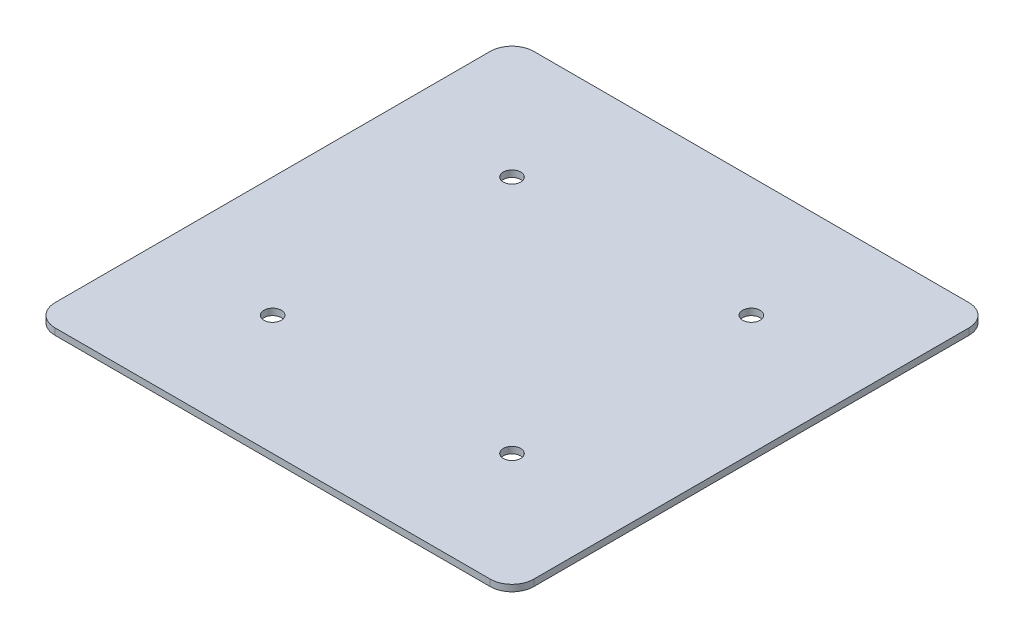
ISO-10303-21;
HEADER;
FILE_DESCRIPTION(('STEP AP214'),'2;1');
FILE_NAME('part.step','',(''),(''),'','','');
FILE_SCHEMA(('AUTOMOTIVE_DESIGN { 1 0 10303 214 1 1 1 1 }'));
ENDSEC;
DATA;
#1=APPLICATION_CONTEXT('core data for automotive mechanical design processes');
#2=APPLICATION_PROTOCOL_DEFINITION('international standard','automotive_design',2000,#1);
#3=PRODUCT_CONTEXT('',#1,'mechanical');
#4=PRODUCT('Part','Part','',(#3));
#5=PRODUCT_RELATED_PRODUCT_CATEGORY('part','',(#4));
#6=PRODUCT_DEFINITION_FORMATION('','',#4);
#7=PRODUCT_DEFINITION_CONTEXT('part definition',#1,'design');
#8=PRODUCT_DEFINITION('design','',#6,#7);
#9=PRODUCT_DEFINITION_SHAPE('','',#8);
#10=(LENGTH_UNIT() NAMED_UNIT(*) SI_UNIT(.MILLI.,.METRE.));
#11=(NAMED_UNIT(*) PLANE_ANGLE_UNIT() SI_UNIT($,.RADIAN.));
#12=(NAMED_UNIT(*) SI_UNIT($,.STERADIAN.) SOLID_ANGLE_UNIT());
#13=UNCERTAINTY_MEASURE_WITH_UNIT(LENGTH_MEASURE(1.E-05),#10,'distance_accuracy_value','');
#14=(GEOMETRIC_REPRESENTATION_CONTEXT(3) GLOBAL_UNCERTAINTY_ASSIGNED_CONTEXT((#13)) GLOBAL_UNIT_ASSIGNED_CONTEXT((#10,
#11,#12)) REPRESENTATION_CONTEXT('',''));
#15=CARTESIAN_POINT('',(0.,0.,0.));
#16=DIRECTION('',(0.,0.,1.));
#17=DIRECTION('',(1.,0.,0.));
#18=AXIS2_PLACEMENT_3D('',#15,#16,#17);
#19=CARTESIAN_POINT('',(0.,1.2,0.));
#20=DIRECTION('',(1.,0.,0.));
#21=DIRECTION('',(0.,0.,-1.));
#22=AXIS2_PLACEMENT_3D('',#19,#20,#21);
#23=PLANE('',#22);
#24=DIRECTION('',(0.,0.,1.));
#25=VECTOR('',#24,1.);
#26=CARTESIAN_POINT('',(0.,1.2,0.));
#27=LINE('',#26,#25);
#28=CARTESIAN_POINT('',(0.,1.2,4.));
#29=VERTEX_POINT('',#28);
#30=CARTESIAN_POINT('',(0.,1.2,84.));
#31=VERTEX_POINT('',#30);
#32=EDGE_CURVE('E130',#29,#31,#27,.T.);
#33=ORIENTED_EDGE('',*,*,#32,.F.);
#34=DIRECTION('',(0.,-1.,0.));
#35=VECTOR('',#34,1.);
#36=CARTESIAN_POINT('',(0.,1.2,4.));
#37=LINE('',#36,#35);
#38=CARTESIAN_POINT('',(0.,0.,4.));
#39=VERTEX_POINT('',#38);
#40=EDGE_CURVE('E115',#29,#39,#37,.T.);
#41=ORIENTED_EDGE('',*,*,#40,.T.);
#42=DIRECTION('',(0.,0.,1.));
#43=VECTOR('',#42,1.);
#44=CARTESIAN_POINT('',(0.,0.,0.));
#45=LINE('',#44,#43);
#46=CARTESIAN_POINT('',(0.,0.,84.));
#47=VERTEX_POINT('',#46);
#48=EDGE_CURVE('E127',#39,#47,#45,.T.);
#49=ORIENTED_EDGE('',*,*,#48,.T.);
#50=DIRECTION('',(0.,-1.,0.));
#51=VECTOR('',#50,1.);
#52=CARTESIAN_POINT('',(0.,1.2,84.));
#53=LINE('',#52,#51);
#54=EDGE_CURVE('E132',#47,#31,#53,.F.);
#55=ORIENTED_EDGE('',*,*,#54,.T.);
#56=EDGE_LOOP('',(#33,#41,#49,#55));
#57=FACE_BOUND('',#56,.T.);
#58=ADVANCED_FACE('F45',(#57),#23,.F.);
#59=CARTESIAN_POINT('',(0.,1.2,88.));
#60=DIRECTION('',(0.,0.,-1.));
#61=DIRECTION('',(-1.,0.,0.));
#62=AXIS2_PLACEMENT_3D('',#59,#60,#61);
#63=PLANE('',#62);
#64=DIRECTION('',(1.,0.,0.));
#65=VECTOR('',#64,1.);
#66=CARTESIAN_POINT('',(0.,0.,88.));
#67=LINE('',#66,#65);
#68=CARTESIAN_POINT('',(4.00000000000001,0.,88.));
#69=VERTEX_POINT('',#68);
#70=CARTESIAN_POINT('',(84.,0.,88.));
#71=VERTEX_POINT('',#70);
#72=EDGE_CURVE('E136',#69,#71,#67,.T.);
#73=ORIENTED_EDGE('',*,*,#72,.T.);
#74=DIRECTION('',(0.,-1.,0.));
#75=VECTOR('',#74,1.);
#76=CARTESIAN_POINT('',(84.,1.2,88.));
#77=LINE('',#76,#75);
#78=CARTESIAN_POINT('',(84.,1.2,88.));
#79=VERTEX_POINT('',#78);
#80=EDGE_CURVE('E12',#71,#79,#77,.F.);
#81=ORIENTED_EDGE('',*,*,#80,.T.);
#82=DIRECTION('',(1.,0.,0.));
#83=VECTOR('',#82,1.);
#84=CARTESIAN_POINT('',(0.,1.2,88.));
#85=LINE('',#84,#83);
#86=CARTESIAN_POINT('',(4.00000000000001,1.2,88.));
#87=VERTEX_POINT('',#86);
#88=EDGE_CURVE('E174',#87,#79,#85,.T.);
#89=ORIENTED_EDGE('',*,*,#88,.F.);
#90=DIRECTION('',(0.,-1.,0.));
#91=VECTOR('',#90,1.);
#92=CARTESIAN_POINT('',(4.00000000000001,1.2,88.));
#93=LINE('',#92,#91);
#94=EDGE_CURVE('E53',#87,#69,#93,.T.);
#95=ORIENTED_EDGE('',*,*,#94,.T.);
#96=EDGE_LOOP('',(#73,#81,#89,#95));
#97=FACE_BOUND('',#96,.T.);
#98=ADVANCED_FACE('F269',(#97),#63,.F.);
#99=CARTESIAN_POINT('',(88.,1.2,0.));
#100=DIRECTION('',(-1.,0.,0.));
#101=DIRECTION('',(0.,0.,1.));
#102=AXIS2_PLACEMENT_3D('',#99,#100,#101);
#103=PLANE('',#102);
#104=DIRECTION('',(0.,0.,-1.));
#105=VECTOR('',#104,1.);
#106=CARTESIAN_POINT('',(88.,0.,0.));
#107=LINE('',#106,#105);
#108=CARTESIAN_POINT('',(88.,0.,84.));
#109=VERTEX_POINT('',#108);
#110=CARTESIAN_POINT('',(88.,0.,4.));
#111=VERTEX_POINT('',#110);
#112=EDGE_CURVE('E140',#109,#111,#107,.T.);
#113=ORIENTED_EDGE('',*,*,#112,.T.);
#114=DIRECTION('',(0.,-1.,0.));
#115=VECTOR('',#114,1.);
#116=CARTESIAN_POINT('',(88.,1.2,4.));
#117=LINE('',#116,#115);
#118=CARTESIAN_POINT('',(88.,1.2,4.));
#119=VERTEX_POINT('',#118);
#120=EDGE_CURVE('E60',#111,#119,#117,.F.);
#121=ORIENTED_EDGE('',*,*,#120,.T.);
#122=DIRECTION('',(0.,0.,-1.));
#123=VECTOR('',#122,1.);
#124=CARTESIAN_POINT('',(88.,1.2,0.));
#125=LINE('',#124,#123);
#126=CARTESIAN_POINT('',(88.,1.2,84.));
#127=VERTEX_POINT('',#126);
#128=EDGE_CURVE('E177',#127,#119,#125,.T.);
#129=ORIENTED_EDGE('',*,*,#128,.F.);
#130=DIRECTION('',(0.,-1.,0.));
#131=VECTOR('',#130,1.);
#132=CARTESIAN_POINT('',(88.,1.2,84.));
#133=LINE('',#132,#131);
#134=EDGE_CURVE('E194',#127,#109,#133,.T.);
#135=ORIENTED_EDGE('',*,*,#134,.T.);
#136=EDGE_LOOP('',(#113,#121,#129,#135));
#137=FACE_BOUND('',#136,.T.);
#138=ADVANCED_FACE('F274',(#137),#103,.F.);
#139=CARTESIAN_POINT('',(0.,1.2,0.));
#140=DIRECTION('',(0.,0.,1.));
#141=DIRECTION('',(1.,0.,0.));
#142=AXIS2_PLACEMENT_3D('',#139,#140,#141);
#143=PLANE('',#142);
#144=DIRECTION('',(-1.,0.,0.));
#145=VECTOR('',#144,1.);
#146=CARTESIAN_POINT('',(0.,0.,0.));
#147=LINE('',#146,#145);
#148=CARTESIAN_POINT('',(84.,0.,0.));
#149=VERTEX_POINT('',#148);
#150=CARTESIAN_POINT('',(4.,0.,0.));
#151=VERTEX_POINT('',#150);
#152=EDGE_CURVE('E152',#149,#151,#147,.T.);
#153=ORIENTED_EDGE('',*,*,#152,.T.);
#154=DIRECTION('',(0.,-1.,0.));
#155=VECTOR('',#154,1.);
#156=CARTESIAN_POINT('',(4.,1.2,0.));
#157=LINE('',#156,#155);
#158=CARTESIAN_POINT('',(4.,1.2,0.));
#159=VERTEX_POINT('',#158);
#160=EDGE_CURVE('E116',#151,#159,#157,.F.);
#161=ORIENTED_EDGE('',*,*,#160,.T.);
#162=DIRECTION('',(-1.,0.,0.));
#163=VECTOR('',#162,1.);
#164=CARTESIAN_POINT('',(0.,1.2,0.));
#165=LINE('',#164,#163);
#166=CARTESIAN_POINT('',(84.,1.2,0.));
#167=VERTEX_POINT('',#166);
#168=EDGE_CURVE('E147',#167,#159,#165,.T.);
#169=ORIENTED_EDGE('',*,*,#168,.F.);
#170=DIRECTION('',(0.,-1.,0.));
#171=VECTOR('',#170,1.);
#172=CARTESIAN_POINT('',(84.,1.2,0.));
#173=LINE('',#172,#171);
#174=EDGE_CURVE('E121',#167,#149,#173,.T.);
#175=ORIENTED_EDGE('',*,*,#174,.T.);
#176=EDGE_LOOP('',(#153,#161,#169,#175));
#177=FACE_BOUND('',#176,.T.);
#178=ADVANCED_FACE('F231',(#177),#143,.F.);
#179=CARTESIAN_POINT('',(0.,1.2,0.));
#180=DIRECTION('',(0.,1.,0.));
#181=DIRECTION('',(0.,0.,1.));
#182=AXIS2_PLACEMENT_3D('',#179,#180,#181);
#183=PLANE('',#182);
#184=CARTESIAN_POINT('',(22.,1.2,66.));
#185=DIRECTION('',(0.,1.,0.));
#186=DIRECTION('',(0.,0.,1.));
#187=AXIS2_PLACEMENT_3D('',#184,#185,#186);
#188=CIRCLE('',#187,1.6);
#189=CARTESIAN_POINT('',(22.,1.2,67.6));
#190=VERTEX_POINT('',#189);
#191=EDGE_CURVE('E137',#190,#190,#188,.T.);
#192=ORIENTED_EDGE('',*,*,#191,.F.);
#193=EDGE_LOOP('',(#192));
#194=FACE_BOUND('',#193,.T.);
#195=CARTESIAN_POINT('',(66.,1.2,66.));
#196=DIRECTION('',(0.,1.,0.));
#197=DIRECTION('',(0.,0.,1.));
#198=AXIS2_PLACEMENT_3D('',#195,#196,#197);
#199=CIRCLE('',#198,1.60000000000001);
#200=CARTESIAN_POINT('',(66.,1.2,67.6));
#201=VERTEX_POINT('',#200);
#202=EDGE_CURVE('E144',#201,#201,#199,.T.);
#203=ORIENTED_EDGE('',*,*,#202,.F.);
#204=EDGE_LOOP('',(#203));
#205=FACE_BOUND('',#204,.T.);
#206=CARTESIAN_POINT('',(66.,1.2,22.));
#207=DIRECTION('',(0.,1.,0.));
#208=DIRECTION('',(0.,0.,1.));
#209=AXIS2_PLACEMENT_3D('',#206,#207,#208);
#210=CIRCLE('',#209,1.6);
#211=CARTESIAN_POINT('',(66.,1.2,23.6));
#212=VERTEX_POINT('',#211);
#213=EDGE_CURVE('E212',#212,#212,#210,.T.);
#214=ORIENTED_EDGE('',*,*,#213,.F.);
#215=EDGE_LOOP('',(#214));
#216=FACE_BOUND('',#215,.T.);
#217=CARTESIAN_POINT('',(22.,1.2,22.));
#218=DIRECTION('',(0.,1.,0.));
#219=DIRECTION('',(0.,0.,1.));
#220=AXIS2_PLACEMENT_3D('',#217,#218,#219);
#221=CIRCLE('',#220,1.6);
#222=CARTESIAN_POINT('',(22.,1.2,23.6));
#223=VERTEX_POINT('',#222);
#224=EDGE_CURVE('E208',#223,#223,#221,.T.);
#225=ORIENTED_EDGE('',*,*,#224,.F.);
#226=EDGE_LOOP('',(#225));
#227=FACE_BOUND('',#226,.T.);
#228=ORIENTED_EDGE('',*,*,#168,.T.);
#229=CARTESIAN_POINT('',(4.,1.2,4.));
#230=DIRECTION('',(0.,1.,0.));
#231=DIRECTION('',(0.,0.,1.));
#232=AXIS2_PLACEMENT_3D('',#229,#230,#231);
#233=CIRCLE('',#232,4.);
#234=EDGE_CURVE('E190',#159,#29,#233,.T.);
#235=ORIENTED_EDGE('',*,*,#234,.T.);
#236=ORIENTED_EDGE('',*,*,#32,.T.);
#237=CARTESIAN_POINT('',(4.00000000000001,1.2,84.));
#238=DIRECTION('',(0.,1.,0.));
#239=DIRECTION('',(0.,0.,1.));
#240=AXIS2_PLACEMENT_3D('',#237,#238,#239);
#241=CIRCLE('',#240,4.);
#242=EDGE_CURVE('E162',#31,#87,#241,.T.);
#243=ORIENTED_EDGE('',*,*,#242,.T.);
#244=ORIENTED_EDGE('',*,*,#88,.T.);
#245=CARTESIAN_POINT('',(84.,1.2,84.));
#246=DIRECTION('',(0.,1.,0.));
#247=DIRECTION('',(0.,0.,1.));
#248=AXIS2_PLACEMENT_3D('',#245,#246,#247);
#249=CIRCLE('',#248,4.);
#250=EDGE_CURVE('E67',#79,#127,#249,.T.);
#251=ORIENTED_EDGE('',*,*,#250,.T.);
#252=ORIENTED_EDGE('',*,*,#128,.T.);
#253=CARTESIAN_POINT('',(84.,1.2,4.));
#254=DIRECTION('',(0.,1.,0.));
#255=DIRECTION('',(0.,0.,1.));
#256=AXIS2_PLACEMENT_3D('',#253,#254,#255);
#257=CIRCLE('',#256,4.);
#258=EDGE_CURVE('E191',#119,#167,#257,.T.);
#259=ORIENTED_EDGE('',*,*,#258,.T.);
#260=EDGE_LOOP('',(#228,#235,#236,#243,#244,#251,#252,#259));
#261=FACE_BOUND('',#260,.T.);
#262=ADVANCED_FACE('F189',(#194,#205,#216,#227,#261),#183,.T.);
#263=CARTESIAN_POINT('',(0.,0.,0.));
#264=DIRECTION('',(0.,1.,0.));
#265=DIRECTION('',(0.,0.,1.));
#266=AXIS2_PLACEMENT_3D('',#263,#264,#265);
#267=PLANE('',#266);
#268=CARTESIAN_POINT('',(22.,0.,66.));
#269=DIRECTION('',(0.,1.,0.));
#270=DIRECTION('',(0.,0.,1.));
#271=AXIS2_PLACEMENT_3D('',#268,#269,#270);
#272=CIRCLE('',#271,1.6);
#273=CARTESIAN_POINT('',(22.,0.,67.6));
#274=VERTEX_POINT('',#273);
#275=EDGE_CURVE('E253',#274,#274,#272,.T.);
#276=ORIENTED_EDGE('',*,*,#275,.T.);
#277=EDGE_LOOP('',(#276));
#278=FACE_BOUND('',#277,.T.);
#279=CARTESIAN_POINT('',(66.,0.,66.));
#280=DIRECTION('',(0.,1.,0.));
#281=DIRECTION('',(0.,0.,1.));
#282=AXIS2_PLACEMENT_3D('',#279,#280,#281);
#283=CIRCLE('',#282,1.60000000000001);
#284=CARTESIAN_POINT('',(66.,0.,67.6));
#285=VERTEX_POINT('',#284);
#286=EDGE_CURVE('E248',#285,#285,#283,.T.);
#287=ORIENTED_EDGE('',*,*,#286,.T.);
#288=EDGE_LOOP('',(#287));
#289=FACE_BOUND('',#288,.T.);
#290=CARTESIAN_POINT('',(66.,0.,22.));
#291=DIRECTION('',(0.,1.,0.));
#292=DIRECTION('',(0.,0.,1.));
#293=AXIS2_PLACEMENT_3D('',#290,#291,#292);
#294=CIRCLE('',#293,1.6);
#295=CARTESIAN_POINT('',(66.,0.,23.6));
#296=VERTEX_POINT('',#295);
#297=EDGE_CURVE('E246',#296,#296,#294,.T.);
#298=ORIENTED_EDGE('',*,*,#297,.T.);
#299=EDGE_LOOP('',(#298));
#300=FACE_BOUND('',#299,.T.);
#301=CARTESIAN_POINT('',(22.,0.,22.));
#302=DIRECTION('',(0.,1.,0.));
#303=DIRECTION('',(0.,0.,1.));
#304=AXIS2_PLACEMENT_3D('',#301,#302,#303);
#305=CIRCLE('',#304,1.6);
#306=CARTESIAN_POINT('',(22.,0.,23.6));
#307=VERTEX_POINT('',#306);
#308=EDGE_CURVE('E213',#307,#307,#305,.T.);
#309=ORIENTED_EDGE('',*,*,#308,.T.);
#310=EDGE_LOOP('',(#309));
#311=FACE_BOUND('',#310,.T.);
#312=ORIENTED_EDGE('',*,*,#48,.F.);
#313=CARTESIAN_POINT('',(4.,0.,4.));
#314=DIRECTION('',(0.,1.,0.));
#315=DIRECTION('',(0.,0.,1.));
#316=AXIS2_PLACEMENT_3D('',#313,#314,#315);
#317=CIRCLE('',#316,4.);
#318=EDGE_CURVE('E111',#39,#151,#317,.F.);
#319=ORIENTED_EDGE('',*,*,#318,.T.);
#320=ORIENTED_EDGE('',*,*,#152,.F.);
#321=CARTESIAN_POINT('',(84.,0.,4.));
#322=DIRECTION('',(0.,1.,0.));
#323=DIRECTION('',(0.,0.,1.));
#324=AXIS2_PLACEMENT_3D('',#321,#322,#323);
#325=CIRCLE('',#324,4.);
#326=EDGE_CURVE('E122',#149,#111,#325,.F.);
#327=ORIENTED_EDGE('',*,*,#326,.T.);
#328=ORIENTED_EDGE('',*,*,#112,.F.);
#329=CARTESIAN_POINT('',(84.,0.,84.));
#330=DIRECTION('',(0.,1.,0.));
#331=DIRECTION('',(0.,0.,1.));
#332=AXIS2_PLACEMENT_3D('',#329,#330,#331);
#333=CIRCLE('',#332,4.);
#334=EDGE_CURVE('E156',#109,#71,#333,.F.);
#335=ORIENTED_EDGE('',*,*,#334,.T.);
#336=ORIENTED_EDGE('',*,*,#72,.F.);
#337=CARTESIAN_POINT('',(4.00000000000001,0.,84.));
#338=DIRECTION('',(0.,1.,0.));
#339=DIRECTION('',(0.,0.,1.));
#340=AXIS2_PLACEMENT_3D('',#337,#338,#339);
#341=CIRCLE('',#340,4.);
#342=EDGE_CURVE('E131',#69,#47,#341,.F.);
#343=ORIENTED_EDGE('',*,*,#342,.T.);
#344=EDGE_LOOP('',(#312,#319,#320,#327,#328,#335,#336,#343));
#345=FACE_BOUND('',#344,.T.);
#346=ADVANCED_FACE('F134',(#278,#289,#300,#311,#345),#267,.F.);
#347=CARTESIAN_POINT('',(4.,1.2,4.));
#348=DIRECTION('',(0.,-1.,0.));
#349=DIRECTION('',(0.,0.,-1.));
#350=AXIS2_PLACEMENT_3D('',#347,#348,#349);
#351=CYLINDRICAL_SURFACE('',#350,4.);
#352=ORIENTED_EDGE('',*,*,#234,.F.);
#353=ORIENTED_EDGE('',*,*,#160,.F.);
#354=ORIENTED_EDGE('',*,*,#318,.F.);
#355=ORIENTED_EDGE('',*,*,#40,.F.);
#356=EDGE_LOOP('',(#352,#353,#354,#355));
#357=FACE_BOUND('',#356,.T.);
#358=ADVANCED_FACE('F114',(#357),#351,.T.);
#359=CARTESIAN_POINT('',(84.,1.2,4.));
#360=DIRECTION('',(0.,-1.,0.));
#361=DIRECTION('',(0.,0.,-1.));
#362=AXIS2_PLACEMENT_3D('',#359,#360,#361);
#363=CYLINDRICAL_SURFACE('',#362,4.);
#364=ORIENTED_EDGE('',*,*,#258,.F.);
#365=ORIENTED_EDGE('',*,*,#120,.F.);
#366=ORIENTED_EDGE('',*,*,#326,.F.);
#367=ORIENTED_EDGE('',*,*,#174,.F.);
#368=EDGE_LOOP('',(#364,#365,#366,#367));
#369=FACE_BOUND('',#368,.T.);
#370=ADVANCED_FACE('F281',(#369),#363,.T.);
#371=CARTESIAN_POINT('',(84.,1.2,84.));
#372=DIRECTION('',(0.,-1.,0.));
#373=DIRECTION('',(0.,0.,-1.));
#374=AXIS2_PLACEMENT_3D('',#371,#372,#373);
#375=CYLINDRICAL_SURFACE('',#374,4.);
#376=ORIENTED_EDGE('',*,*,#250,.F.);
#377=ORIENTED_EDGE('',*,*,#80,.F.);
#378=ORIENTED_EDGE('',*,*,#334,.F.);
#379=ORIENTED_EDGE('',*,*,#134,.F.);
#380=EDGE_LOOP('',(#376,#377,#378,#379));
#381=FACE_BOUND('',#380,.T.);
#382=ADVANCED_FACE('F283',(#381),#375,.T.);
#383=CARTESIAN_POINT('',(4.00000000000001,1.2,84.));
#384=DIRECTION('',(0.,-1.,0.));
#385=DIRECTION('',(0.,0.,-1.));
#386=AXIS2_PLACEMENT_3D('',#383,#384,#385);
#387=CYLINDRICAL_SURFACE('',#386,4.);
#388=ORIENTED_EDGE('',*,*,#242,.F.);
#389=ORIENTED_EDGE('',*,*,#54,.F.);
#390=ORIENTED_EDGE('',*,*,#342,.F.);
#391=ORIENTED_EDGE('',*,*,#94,.F.);
#392=EDGE_LOOP('',(#388,#389,#390,#391));
#393=FACE_BOUND('',#392,.T.);
#394=ADVANCED_FACE('F47',(#393),#387,.T.);
#395=CARTESIAN_POINT('',(22.,0.,22.));
#396=DIRECTION('',(0.,1.,0.));
#397=DIRECTION('',(0.,0.,1.));
#398=AXIS2_PLACEMENT_3D('',#395,#396,#397);
#399=CYLINDRICAL_SURFACE('',#398,1.6);
#400=ORIENTED_EDGE('',*,*,#224,.T.);
#401=EDGE_LOOP('',(#400));
#402=FACE_BOUND('',#401,.T.);
#403=ORIENTED_EDGE('',*,*,#308,.F.);
#404=EDGE_LOOP('',(#403));
#405=FACE_BOUND('',#404,.T.);
#406=ADVANCED_FACE('F238',(#402,#405),#399,.F.);
#407=CARTESIAN_POINT('',(66.,0.,22.));
#408=DIRECTION('',(0.,1.,0.));
#409=DIRECTION('',(0.,0.,1.));
#410=AXIS2_PLACEMENT_3D('',#407,#408,#409);
#411=CYLINDRICAL_SURFACE('',#410,1.6);
#412=ORIENTED_EDGE('',*,*,#213,.T.);
#413=EDGE_LOOP('',(#412));
#414=FACE_BOUND('',#413,.T.);
#415=ORIENTED_EDGE('',*,*,#297,.F.);
#416=EDGE_LOOP('',(#415));
#417=FACE_BOUND('',#416,.T.);
#418=ADVANCED_FACE('F241',(#414,#417),#411,.F.);
#419=CARTESIAN_POINT('',(66.,0.,66.));
#420=DIRECTION('',(0.,1.,0.));
#421=DIRECTION('',(0.,0.,1.));
#422=AXIS2_PLACEMENT_3D('',#419,#420,#421);
#423=CYLINDRICAL_SURFACE('',#422,1.60000000000001);
#424=ORIENTED_EDGE('',*,*,#202,.T.);
#425=EDGE_LOOP('',(#424));
#426=FACE_BOUND('',#425,.T.);
#427=ORIENTED_EDGE('',*,*,#286,.F.);
#428=EDGE_LOOP('',(#427));
#429=FACE_BOUND('',#428,.T.);
#430=ADVANCED_FACE('F226',(#426,#429),#423,.F.);
#431=CARTESIAN_POINT('',(22.,0.,66.));
#432=DIRECTION('',(0.,1.,0.));
#433=DIRECTION('',(0.,0.,1.));
#434=AXIS2_PLACEMENT_3D('',#431,#432,#433);
#435=CYLINDRICAL_SURFACE('',#434,1.6);
#436=ORIENTED_EDGE('',*,*,#191,.T.);
#437=EDGE_LOOP('',(#436));
#438=FACE_BOUND('',#437,.T.);
#439=ORIENTED_EDGE('',*,*,#275,.F.);
#440=EDGE_LOOP('',(#439));
#441=FACE_BOUND('',#440,.T.);
#442=ADVANCED_FACE('F260',(#438,#441),#435,.F.);
#443=CLOSED_SHELL('',(#58,#98,#138,#178,#262,#346,#358,#370,#382,#394,#406,#418,#430,#442));
#444=MANIFOLD_SOLID_BREP('B2',#443);
#445=ADVANCED_BREP_SHAPE_REPRESENTATION('',(#18,#444),#14);
#446=SHAPE_DEFINITION_REPRESENTATION(#9,#445);
ENDSEC;
END-ISO-10303-21;
